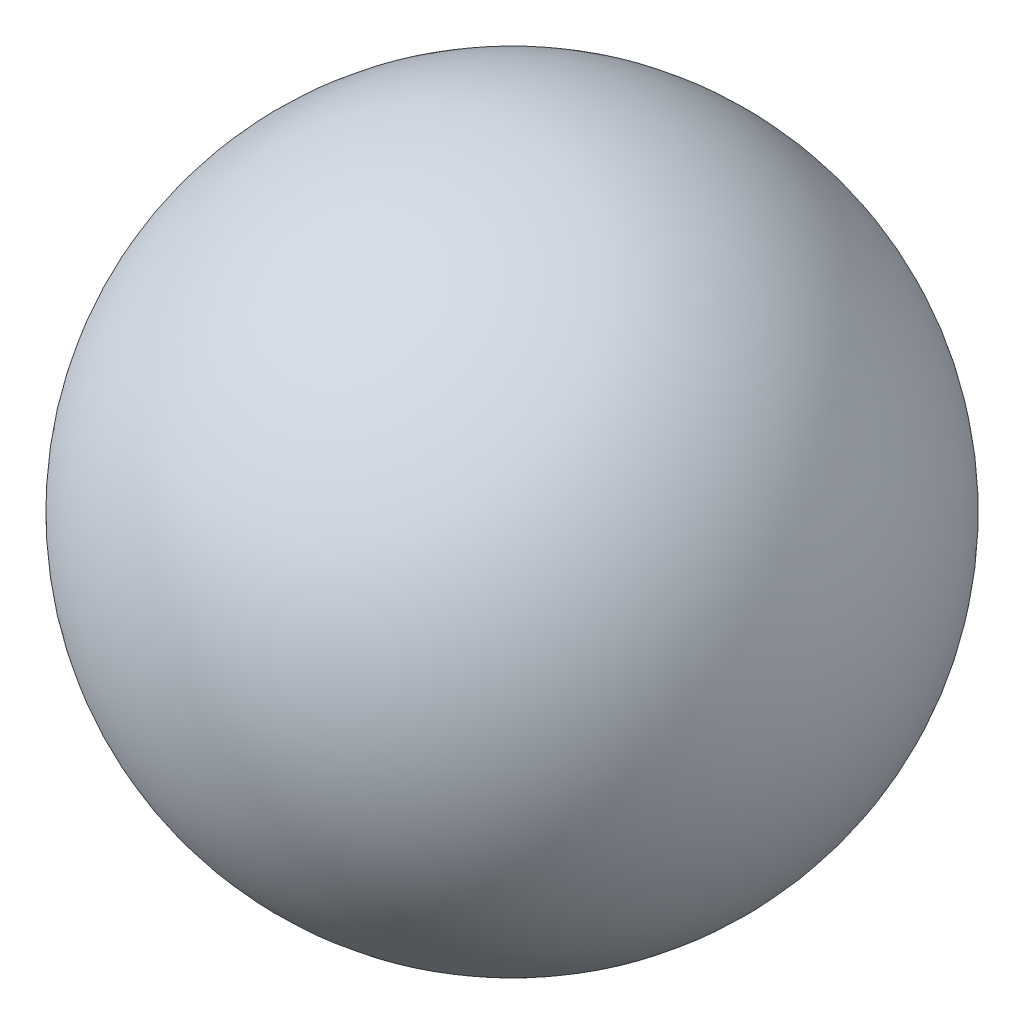
ISO-10303-21;
HEADER;
FILE_DESCRIPTION(('STEP AP214'),'2;1');
FILE_NAME('part.step','',(''),(''),'','','');
FILE_SCHEMA(('AUTOMOTIVE_DESIGN { 1 0 10303 214 1 1 1 1 }'));
ENDSEC;
DATA;
#1=APPLICATION_CONTEXT('core data for automotive mechanical design processes');
#2=APPLICATION_PROTOCOL_DEFINITION('international standard','automotive_design',2000,#1);
#3=PRODUCT_CONTEXT('',#1,'mechanical');
#4=PRODUCT('Part','Part','',(#3));
#5=PRODUCT_RELATED_PRODUCT_CATEGORY('part','',(#4));
#6=PRODUCT_DEFINITION_FORMATION('','',#4);
#7=PRODUCT_DEFINITION_CONTEXT('part definition',#1,'design');
#8=PRODUCT_DEFINITION('design','',#6,#7);
#9=PRODUCT_DEFINITION_SHAPE('','',#8);
#10=(LENGTH_UNIT() NAMED_UNIT(*) SI_UNIT(.MILLI.,.METRE.));
#11=(NAMED_UNIT(*) PLANE_ANGLE_UNIT() SI_UNIT($,.RADIAN.));
#12=(NAMED_UNIT(*) SI_UNIT($,.STERADIAN.) SOLID_ANGLE_UNIT());
#13=UNCERTAINTY_MEASURE_WITH_UNIT(LENGTH_MEASURE(1.E-05),#10,'distance_accuracy_value','');
#14=(GEOMETRIC_REPRESENTATION_CONTEXT(3) GLOBAL_UNCERTAINTY_ASSIGNED_CONTEXT((#13)) GLOBAL_UNIT_ASSIGNED_CONTEXT((#10,
#11,#12)) REPRESENTATION_CONTEXT('',''));
#15=CARTESIAN_POINT('',(0.,0.,0.));
#16=DIRECTION('',(0.,0.,1.));
#17=DIRECTION('',(1.,0.,0.));
#18=AXIS2_PLACEMENT_3D('',#15,#16,#17);
#19=CARTESIAN_POINT('',(0.,0.,0.));
#20=DIRECTION('',(0.,1.,0.));
#21=DIRECTION('',(1.,0.,0.));
#22=AXIS2_PLACEMENT_3D('',#19,#20,#21);
#23=SPHERICAL_SURFACE('',#22,19.05);
#24=CARTESIAN_POINT('',(0.,19.05,0.));
#25=VERTEX_POINT('',#24);
#26=VERTEX_LOOP('',#25);
#27=FACE_BOUND('',#26,.T.);
#28=ADVANCED_FACE('F31',(#27),#23,.T.);
#29=CLOSED_SHELL('',(#28));
#30=MANIFOLD_SOLID_BREP('B2',#29);
#31=ADVANCED_BREP_SHAPE_REPRESENTATION('',(#18,#30),#14);
#32=SHAPE_DEFINITION_REPRESENTATION(#9,#31);
ENDSEC;
END-ISO-10303-21;
